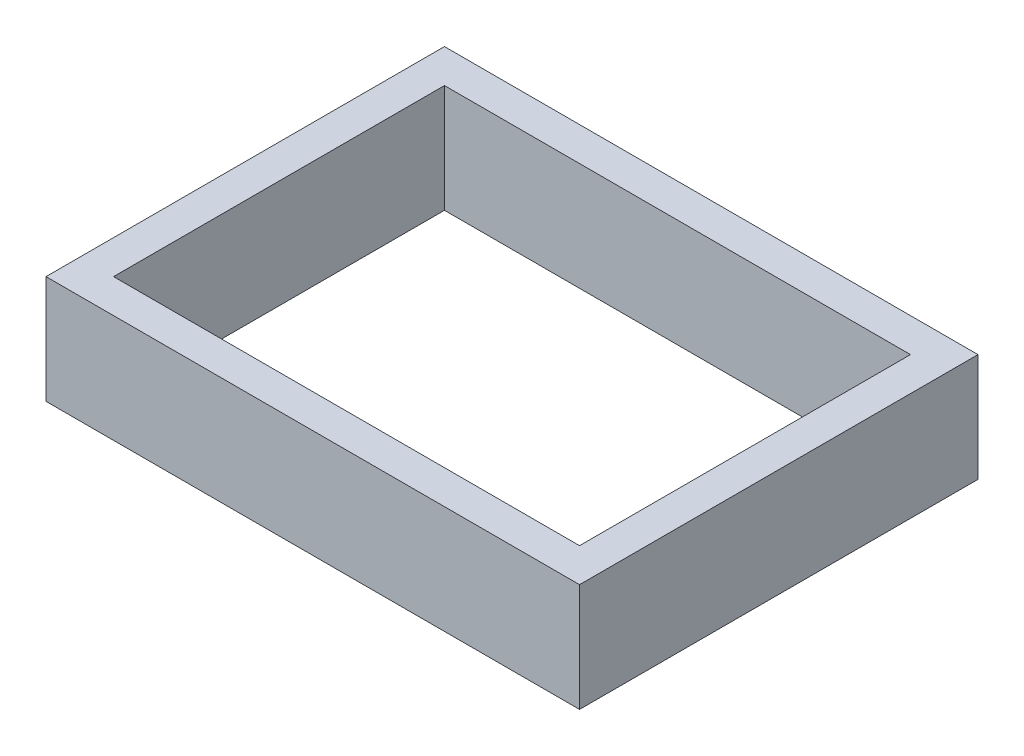
ISO-10303-21;
HEADER;
FILE_DESCRIPTION(('STEP AP214'),'2;1');
FILE_NAME('part.step','',(''),(''),'','','');
FILE_SCHEMA(('AUTOMOTIVE_DESIGN { 1 0 10303 214 1 1 1 1 }'));
ENDSEC;
DATA;
#1=APPLICATION_CONTEXT('core data for automotive mechanical design processes');
#2=APPLICATION_PROTOCOL_DEFINITION('international standard','automotive_design',2000,#1);
#3=PRODUCT_CONTEXT('',#1,'mechanical');
#4=PRODUCT('Part','Part','',(#3));
#5=PRODUCT_RELATED_PRODUCT_CATEGORY('part','',(#4));
#6=PRODUCT_DEFINITION_FORMATION('','',#4);
#7=PRODUCT_DEFINITION_CONTEXT('part definition',#1,'design');
#8=PRODUCT_DEFINITION('design','',#6,#7);
#9=PRODUCT_DEFINITION_SHAPE('','',#8);
#10=(LENGTH_UNIT() NAMED_UNIT(*) SI_UNIT(.MILLI.,.METRE.));
#11=(NAMED_UNIT(*) PLANE_ANGLE_UNIT() SI_UNIT($,.RADIAN.));
#12=(NAMED_UNIT(*) SI_UNIT($,.STERADIAN.) SOLID_ANGLE_UNIT());
#13=UNCERTAINTY_MEASURE_WITH_UNIT(LENGTH_MEASURE(1.E-05),#10,'distance_accuracy_value','');
#14=(GEOMETRIC_REPRESENTATION_CONTEXT(3) GLOBAL_UNCERTAINTY_ASSIGNED_CONTEXT((#13)) GLOBAL_UNIT_ASSIGNED_CONTEXT((#10,
#11,#12)) REPRESENTATION_CONTEXT('',''));
#15=CARTESIAN_POINT('',(0.,0.,0.));
#16=DIRECTION('',(0.,0.,1.));
#17=DIRECTION('',(1.,0.,0.));
#18=AXIS2_PLACEMENT_3D('',#15,#16,#17);
#19=CARTESIAN_POINT('',(0.,304.8,0.));
#20=DIRECTION('',(0.,1.,0.));
#21=DIRECTION('',(0.,0.,1.));
#22=AXIS2_PLACEMENT_3D('',#19,#20,#21);
#23=PLANE('',#22);
#24=DIRECTION('',(0.,0.,-1.));
#25=VECTOR('',#24,1.);
#26=CARTESIAN_POINT('',(63.5,304.8,63.5));
#27=LINE('',#26,#25);
#28=CARTESIAN_POINT('',(63.5,304.8,63.5));
#29=VERTEX_POINT('',#28);
#30=CARTESIAN_POINT('',(63.5,304.8,-685.8));
#31=VERTEX_POINT('',#30);
#32=EDGE_CURVE('E134',#29,#31,#27,.T.);
#33=ORIENTED_EDGE('',*,*,#32,.T.);
#34=DIRECTION('',(-1.,0.,0.));
#35=VECTOR('',#34,1.);
#36=CARTESIAN_POINT('',(63.5,304.8,-685.8));
#37=LINE('',#36,#35);
#38=CARTESIAN_POINT('',(-939.8,304.8,-685.8));
#39=VERTEX_POINT('',#38);
#40=EDGE_CURVE('E137',#31,#39,#37,.T.);
#41=ORIENTED_EDGE('',*,*,#40,.T.);
#42=DIRECTION('',(0.,0.,1.));
#43=VECTOR('',#42,1.);
#44=CARTESIAN_POINT('',(-939.8,304.8,63.5000000000001));
#45=LINE('',#44,#43);
#46=CARTESIAN_POINT('',(-939.8,304.8,63.5000000000001));
#47=VERTEX_POINT('',#46);
#48=EDGE_CURVE('E140',#39,#47,#45,.T.);
#49=ORIENTED_EDGE('',*,*,#48,.T.);
#50=DIRECTION('',(1.,0.,0.));
#51=VECTOR('',#50,1.);
#52=CARTESIAN_POINT('',(63.5,304.8,63.5));
#53=LINE('',#52,#51);
#54=EDGE_CURVE('E142',#47,#29,#53,.T.);
#55=ORIENTED_EDGE('',*,*,#54,.T.);
#56=EDGE_LOOP('',(#33,#41,#49,#55));
#57=FACE_BOUND('',#56,.T.);
#58=DIRECTION('',(-1.,0.,0.));
#59=VECTOR('',#58,1.);
#60=CARTESIAN_POINT('',(0.,304.8,-622.3));
#61=LINE('',#60,#59);
#62=CARTESIAN_POINT('',(0.,304.8,-622.3));
#63=VERTEX_POINT('',#62);
#64=CARTESIAN_POINT('',(-876.3,304.8,-622.3));
#65=VERTEX_POINT('',#64);
#66=EDGE_CURVE('E106',#63,#65,#61,.T.);
#67=ORIENTED_EDGE('',*,*,#66,.F.);
#68=DIRECTION('',(0.,0.,-1.));
#69=VECTOR('',#68,1.);
#70=CARTESIAN_POINT('',(0.,304.8,0.));
#71=LINE('',#70,#69);
#72=CARTESIAN_POINT('',(0.,304.8,0.));
#73=VERTEX_POINT('',#72);
#74=EDGE_CURVE('E98',#73,#63,#71,.T.);
#75=ORIENTED_EDGE('',*,*,#74,.F.);
#76=DIRECTION('',(1.,0.,0.));
#77=VECTOR('',#76,1.);
#78=CARTESIAN_POINT('',(0.,304.8,0.));
#79=LINE('',#78,#77);
#80=CARTESIAN_POINT('',(-876.3,304.8,1.47391267116828E-13));
#81=VERTEX_POINT('',#80);
#82=EDGE_CURVE('E120',#81,#73,#79,.T.);
#83=ORIENTED_EDGE('',*,*,#82,.F.);
#84=DIRECTION('',(0.,0.,1.));
#85=VECTOR('',#84,1.);
#86=CARTESIAN_POINT('',(-876.3,304.8,1.47391267116828E-13));
#87=LINE('',#86,#85);
#88=EDGE_CURVE('E118',#65,#81,#87,.T.);
#89=ORIENTED_EDGE('',*,*,#88,.F.);
#90=EDGE_LOOP('',(#67,#75,#83,#89));
#91=FACE_BOUND('',#90,.T.);
#92=ADVANCED_FACE('F33',(#57,#91),#23,.T.);
#93=CARTESIAN_POINT('',(0.,101.6,0.));
#94=DIRECTION('',(0.,1.,0.));
#95=DIRECTION('',(0.,0.,1.));
#96=AXIS2_PLACEMENT_3D('',#93,#94,#95);
#97=PLANE('',#96);
#98=DIRECTION('',(0.,0.,-1.));
#99=VECTOR('',#98,1.);
#100=CARTESIAN_POINT('',(63.5,101.6,63.5));
#101=LINE('',#100,#99);
#102=CARTESIAN_POINT('',(63.5,101.6,63.5));
#103=VERTEX_POINT('',#102);
#104=CARTESIAN_POINT('',(63.5,101.6,-685.8));
#105=VERTEX_POINT('',#104);
#106=EDGE_CURVE('E114',#103,#105,#101,.T.);
#107=ORIENTED_EDGE('',*,*,#106,.F.);
#108=DIRECTION('',(1.,0.,0.));
#109=VECTOR('',#108,1.);
#110=CARTESIAN_POINT('',(63.5,101.6,63.5));
#111=LINE('',#110,#109);
#112=CARTESIAN_POINT('',(-939.8,101.6,63.5000000000001));
#113=VERTEX_POINT('',#112);
#114=EDGE_CURVE('E138',#113,#103,#111,.T.);
#115=ORIENTED_EDGE('',*,*,#114,.F.);
#116=DIRECTION('',(0.,0.,1.));
#117=VECTOR('',#116,1.);
#118=CARTESIAN_POINT('',(-939.8,101.6,63.5000000000001));
#119=LINE('',#118,#117);
#120=CARTESIAN_POINT('',(-939.8,101.6,-685.8));
#121=VERTEX_POINT('',#120);
#122=EDGE_CURVE('E149',#121,#113,#119,.T.);
#123=ORIENTED_EDGE('',*,*,#122,.F.);
#124=DIRECTION('',(-1.,0.,0.));
#125=VECTOR('',#124,1.);
#126=CARTESIAN_POINT('',(63.5,101.6,-685.8));
#127=LINE('',#126,#125);
#128=EDGE_CURVE('E147',#105,#121,#127,.T.);
#129=ORIENTED_EDGE('',*,*,#128,.F.);
#130=EDGE_LOOP('',(#107,#115,#123,#129));
#131=FACE_BOUND('',#130,.T.);
#132=DIRECTION('',(0.,0.,-1.));
#133=VECTOR('',#132,1.);
#134=CARTESIAN_POINT('',(0.,101.6,0.));
#135=LINE('',#134,#133);
#136=CARTESIAN_POINT('',(0.,101.6,0.));
#137=VERTEX_POINT('',#136);
#138=CARTESIAN_POINT('',(0.,101.6,-622.3));
#139=VERTEX_POINT('',#138);
#140=EDGE_CURVE('E56',#137,#139,#135,.T.);
#141=ORIENTED_EDGE('',*,*,#140,.T.);
#142=DIRECTION('',(-1.,0.,0.));
#143=VECTOR('',#142,1.);
#144=CARTESIAN_POINT('',(0.,101.6,-622.3));
#145=LINE('',#144,#143);
#146=CARTESIAN_POINT('',(-876.3,101.6,-622.3));
#147=VERTEX_POINT('',#146);
#148=EDGE_CURVE('E113',#139,#147,#145,.T.);
#149=ORIENTED_EDGE('',*,*,#148,.T.);
#150=DIRECTION('',(0.,0.,1.));
#151=VECTOR('',#150,1.);
#152=CARTESIAN_POINT('',(-876.3,101.6,1.47391267116828E-13));
#153=LINE('',#152,#151);
#154=CARTESIAN_POINT('',(-876.3,101.6,1.47391267116828E-13));
#155=VERTEX_POINT('',#154);
#156=EDGE_CURVE('E126',#147,#155,#153,.T.);
#157=ORIENTED_EDGE('',*,*,#156,.T.);
#158=DIRECTION('',(1.,0.,0.));
#159=VECTOR('',#158,1.);
#160=CARTESIAN_POINT('',(0.,101.6,0.));
#161=LINE('',#160,#159);
#162=EDGE_CURVE('E107',#155,#137,#161,.T.);
#163=ORIENTED_EDGE('',*,*,#162,.T.);
#164=EDGE_LOOP('',(#141,#149,#157,#163));
#165=FACE_BOUND('',#164,.T.);
#166=ADVANCED_FACE('F167',(#131,#165),#97,.F.);
#167=CARTESIAN_POINT('',(63.5,304.8,63.5));
#168=DIRECTION('',(-1.,0.,0.));
#169=DIRECTION('',(0.,0.,1.));
#170=AXIS2_PLACEMENT_3D('',#167,#168,#169);
#171=PLANE('',#170);
#172=ORIENTED_EDGE('',*,*,#106,.T.);
#173=DIRECTION('',(0.,-1.,0.));
#174=VECTOR('',#173,1.);
#175=CARTESIAN_POINT('',(63.5,304.8,-685.8));
#176=LINE('',#175,#174);
#177=EDGE_CURVE('E11',#31,#105,#176,.T.);
#178=ORIENTED_EDGE('',*,*,#177,.F.);
#179=ORIENTED_EDGE('',*,*,#32,.F.);
#180=DIRECTION('',(0.,-1.,0.));
#181=VECTOR('',#180,1.);
#182=CARTESIAN_POINT('',(63.5,304.8,63.5));
#183=LINE('',#182,#181);
#184=EDGE_CURVE('E144',#29,#103,#183,.T.);
#185=ORIENTED_EDGE('',*,*,#184,.T.);
#186=EDGE_LOOP('',(#172,#178,#179,#185));
#187=FACE_BOUND('',#186,.T.);
#188=ADVANCED_FACE('F35',(#187),#171,.F.);
#189=CARTESIAN_POINT('',(63.5,304.8,-685.8));
#190=DIRECTION('',(0.,0.,1.));
#191=DIRECTION('',(1.,0.,0.));
#192=AXIS2_PLACEMENT_3D('',#189,#190,#191);
#193=PLANE('',#192);
#194=ORIENTED_EDGE('',*,*,#128,.T.);
#195=DIRECTION('',(0.,-1.,0.));
#196=VECTOR('',#195,1.);
#197=CARTESIAN_POINT('',(-939.8,304.8,-685.8));
#198=LINE('',#197,#196);
#199=EDGE_CURVE('E41',#39,#121,#198,.T.);
#200=ORIENTED_EDGE('',*,*,#199,.F.);
#201=ORIENTED_EDGE('',*,*,#40,.F.);
#202=ORIENTED_EDGE('',*,*,#177,.T.);
#203=EDGE_LOOP('',(#194,#200,#201,#202));
#204=FACE_BOUND('',#203,.T.);
#205=ADVANCED_FACE('F177',(#204),#193,.F.);
#206=CARTESIAN_POINT('',(-939.8,304.8,63.5000000000001));
#207=DIRECTION('',(1.,0.,0.));
#208=DIRECTION('',(0.,0.,-1.));
#209=AXIS2_PLACEMENT_3D('',#206,#207,#208);
#210=PLANE('',#209);
#211=ORIENTED_EDGE('',*,*,#122,.T.);
#212=DIRECTION('',(0.,-1.,0.));
#213=VECTOR('',#212,1.);
#214=CARTESIAN_POINT('',(-939.8,304.8,63.5000000000001));
#215=LINE('',#214,#213);
#216=EDGE_CURVE('E154',#47,#113,#215,.T.);
#217=ORIENTED_EDGE('',*,*,#216,.F.);
#218=ORIENTED_EDGE('',*,*,#48,.F.);
#219=ORIENTED_EDGE('',*,*,#199,.T.);
#220=EDGE_LOOP('',(#211,#217,#218,#219));
#221=FACE_BOUND('',#220,.T.);
#222=ADVANCED_FACE('F161',(#221),#210,.F.);
#223=CARTESIAN_POINT('',(63.5,304.8,63.5));
#224=DIRECTION('',(0.,0.,-1.));
#225=DIRECTION('',(-1.,0.,0.));
#226=AXIS2_PLACEMENT_3D('',#223,#224,#225);
#227=PLANE('',#226);
#228=ORIENTED_EDGE('',*,*,#114,.T.);
#229=ORIENTED_EDGE('',*,*,#184,.F.);
#230=ORIENTED_EDGE('',*,*,#54,.F.);
#231=ORIENTED_EDGE('',*,*,#216,.T.);
#232=EDGE_LOOP('',(#228,#229,#230,#231));
#233=FACE_BOUND('',#232,.T.);
#234=ADVANCED_FACE('F171',(#233),#227,.F.);
#235=CARTESIAN_POINT('',(0.,304.8,0.));
#236=DIRECTION('',(-1.,0.,0.));
#237=DIRECTION('',(0.,0.,1.));
#238=AXIS2_PLACEMENT_3D('',#235,#236,#237);
#239=PLANE('',#238);
#240=ORIENTED_EDGE('',*,*,#140,.F.);
#241=DIRECTION('',(0.,-1.,0.));
#242=VECTOR('',#241,1.);
#243=CARTESIAN_POINT('',(0.,304.8,0.));
#244=LINE('',#243,#242);
#245=EDGE_CURVE('E102',#73,#137,#244,.T.);
#246=ORIENTED_EDGE('',*,*,#245,.F.);
#247=ORIENTED_EDGE('',*,*,#74,.T.);
#248=DIRECTION('',(0.,-1.,0.));
#249=VECTOR('',#248,1.);
#250=CARTESIAN_POINT('',(0.,304.8,-622.3));
#251=LINE('',#250,#249);
#252=EDGE_CURVE('E101',#63,#139,#251,.T.);
#253=ORIENTED_EDGE('',*,*,#252,.T.);
#254=EDGE_LOOP('',(#240,#246,#247,#253));
#255=FACE_BOUND('',#254,.T.);
#256=ADVANCED_FACE('F100',(#255),#239,.T.);
#257=CARTESIAN_POINT('',(0.,304.8,-622.3));
#258=DIRECTION('',(0.,0.,1.));
#259=DIRECTION('',(1.,0.,0.));
#260=AXIS2_PLACEMENT_3D('',#257,#258,#259);
#261=PLANE('',#260);
#262=ORIENTED_EDGE('',*,*,#148,.F.);
#263=ORIENTED_EDGE('',*,*,#252,.F.);
#264=ORIENTED_EDGE('',*,*,#66,.T.);
#265=DIRECTION('',(0.,-1.,0.));
#266=VECTOR('',#265,1.);
#267=CARTESIAN_POINT('',(-876.3,304.8,-622.3));
#268=LINE('',#267,#266);
#269=EDGE_CURVE('E115',#65,#147,#268,.T.);
#270=ORIENTED_EDGE('',*,*,#269,.T.);
#271=EDGE_LOOP('',(#262,#263,#264,#270));
#272=FACE_BOUND('',#271,.T.);
#273=ADVANCED_FACE('F110',(#272),#261,.T.);
#274=CARTESIAN_POINT('',(-876.3,304.8,1.47391267116828E-13));
#275=DIRECTION('',(1.,0.,0.));
#276=DIRECTION('',(0.,0.,-1.));
#277=AXIS2_PLACEMENT_3D('',#274,#275,#276);
#278=PLANE('',#277);
#279=ORIENTED_EDGE('',*,*,#156,.F.);
#280=ORIENTED_EDGE('',*,*,#269,.F.);
#281=ORIENTED_EDGE('',*,*,#88,.T.);
#282=DIRECTION('',(0.,-1.,0.));
#283=VECTOR('',#282,1.);
#284=CARTESIAN_POINT('',(-876.3,304.8,1.47391267116828E-13));
#285=LINE('',#284,#283);
#286=EDGE_CURVE('E48',#81,#155,#285,.T.);
#287=ORIENTED_EDGE('',*,*,#286,.T.);
#288=EDGE_LOOP('',(#279,#280,#281,#287));
#289=FACE_BOUND('',#288,.T.);
#290=ADVANCED_FACE('F200',(#289),#278,.T.);
#291=CARTESIAN_POINT('',(0.,304.8,0.));
#292=DIRECTION('',(0.,0.,-1.));
#293=DIRECTION('',(-1.,0.,0.));
#294=AXIS2_PLACEMENT_3D('',#291,#292,#293);
#295=PLANE('',#294);
#296=ORIENTED_EDGE('',*,*,#162,.F.);
#297=ORIENTED_EDGE('',*,*,#286,.F.);
#298=ORIENTED_EDGE('',*,*,#82,.T.);
#299=ORIENTED_EDGE('',*,*,#245,.T.);
#300=EDGE_LOOP('',(#296,#297,#298,#299));
#301=FACE_BOUND('',#300,.T.);
#302=ADVANCED_FACE('F204',(#301),#295,.T.);
#303=CLOSED_SHELL('',(#92,#166,#188,#205,#222,#234,#256,#273,#290,#302));
#304=MANIFOLD_SOLID_BREP('B2',#303);
#305=ADVANCED_BREP_SHAPE_REPRESENTATION('',(#18,#304),#14);
#306=SHAPE_DEFINITION_REPRESENTATION(#9,#305);
ENDSEC;
END-ISO-10303-21;
